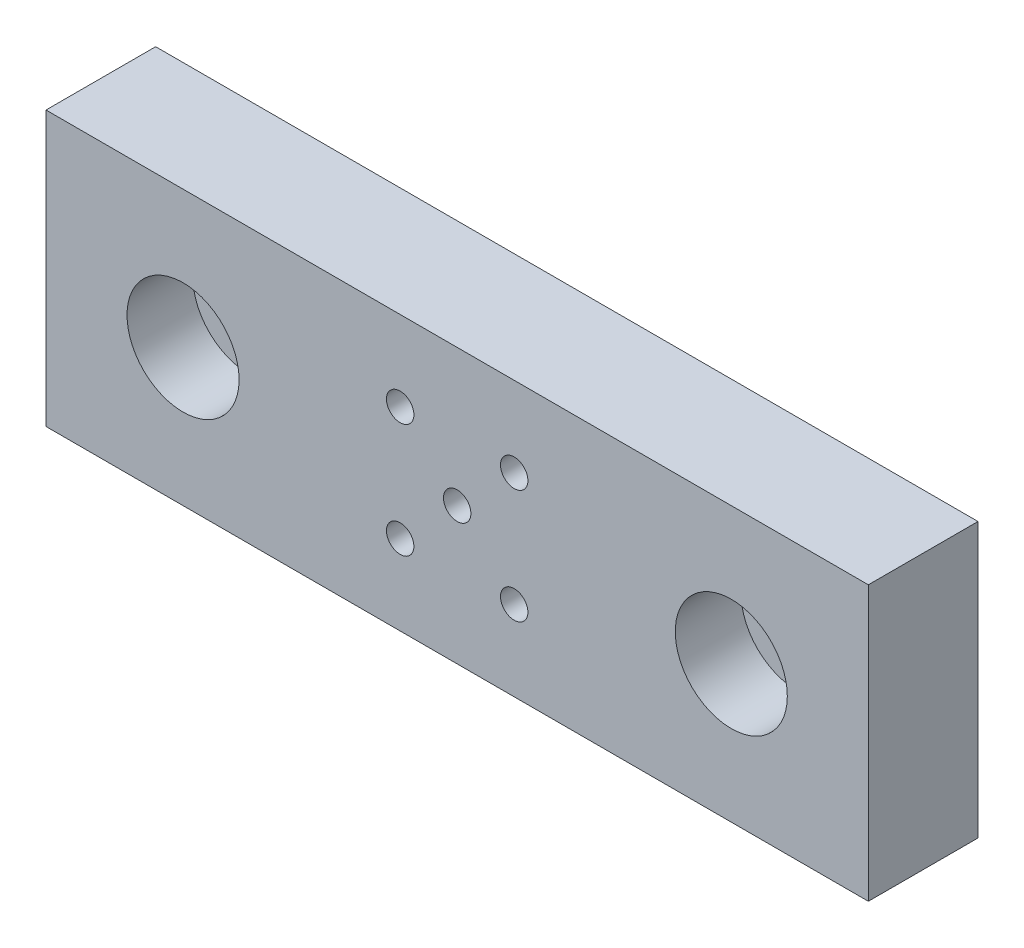
ISO-10303-21;
HEADER;
FILE_DESCRIPTION(('STEP AP214'),'2;1');
FILE_NAME('part.step','',(''),(''),'','','');
FILE_SCHEMA(('AUTOMOTIVE_DESIGN { 1 0 10303 214 1 1 1 1 }'));
ENDSEC;
DATA;
#1=APPLICATION_CONTEXT('core data for automotive mechanical design processes');
#2=APPLICATION_PROTOCOL_DEFINITION('international standard','automotive_design',2000,#1);
#3=PRODUCT_CONTEXT('',#1,'mechanical');
#4=PRODUCT('Part','Part','',(#3));
#5=PRODUCT_RELATED_PRODUCT_CATEGORY('part','',(#4));
#6=PRODUCT_DEFINITION_FORMATION('','',#4);
#7=PRODUCT_DEFINITION_CONTEXT('part definition',#1,'design');
#8=PRODUCT_DEFINITION('design','',#6,#7);
#9=PRODUCT_DEFINITION_SHAPE('','',#8);
#10=(LENGTH_UNIT() NAMED_UNIT(*) SI_UNIT(.MILLI.,.METRE.));
#11=(NAMED_UNIT(*) PLANE_ANGLE_UNIT() SI_UNIT($,.RADIAN.));
#12=(NAMED_UNIT(*) SI_UNIT($,.STERADIAN.) SOLID_ANGLE_UNIT());
#13=UNCERTAINTY_MEASURE_WITH_UNIT(LENGTH_MEASURE(1.E-05),#10,'distance_accuracy_value','');
#14=(GEOMETRIC_REPRESENTATION_CONTEXT(3) GLOBAL_UNCERTAINTY_ASSIGNED_CONTEXT((#13)) GLOBAL_UNIT_ASSIGNED_CONTEXT((#10,
#11,#12)) REPRESENTATION_CONTEXT('',''));
#15=CARTESIAN_POINT('',(0.,0.,0.));
#16=DIRECTION('',(0.,0.,1.));
#17=DIRECTION('',(1.,0.,0.));
#18=AXIS2_PLACEMENT_3D('',#15,#16,#17);
#19=CARTESIAN_POINT('',(25.,0.,10.));
#20=DIRECTION('',(0.,0.,-1.));
#21=DIRECTION('',(-1.,0.,0.));
#22=AXIS2_PLACEMENT_3D('',#19,#20,#21);
#23=CYLINDRICAL_SURFACE('',#22,3.25);
#24=CARTESIAN_POINT('',(25.,0.,0.));
#25=DIRECTION('',(0.,0.,1.));
#26=DIRECTION('',(1.,0.,0.));
#27=AXIS2_PLACEMENT_3D('',#24,#25,#26);
#28=CIRCLE('',#27,3.25);
#29=CARTESIAN_POINT('',(28.25,0.,0.));
#30=VERTEX_POINT('',#29);
#31=EDGE_CURVE('E155',#30,#30,#28,.T.);
#32=ORIENTED_EDGE('',*,*,#31,.F.);
#33=EDGE_LOOP('',(#32));
#34=FACE_BOUND('',#33,.T.);
#35=CARTESIAN_POINT('',(25.,0.,4.));
#36=DIRECTION('',(0.,0.,1.));
#37=DIRECTION('',(1.,0.,0.));
#38=AXIS2_PLACEMENT_3D('',#35,#36,#37);
#39=CIRCLE('',#38,3.25);
#40=CARTESIAN_POINT('',(28.25,0.,4.));
#41=VERTEX_POINT('',#40);
#42=EDGE_CURVE('E38',#41,#41,#39,.T.);
#43=ORIENTED_EDGE('',*,*,#42,.T.);
#44=EDGE_LOOP('',(#43));
#45=FACE_BOUND('',#44,.T.);
#46=ADVANCED_FACE('F34',(#34,#45),#23,.F.);
#47=CARTESIAN_POINT('',(-25.,0.,10.));
#48=DIRECTION('',(0.,0.,-1.));
#49=DIRECTION('',(-1.,0.,0.));
#50=AXIS2_PLACEMENT_3D('',#47,#48,#49);
#51=CYLINDRICAL_SURFACE('',#50,3.25);
#52=CARTESIAN_POINT('',(-25.,0.,0.));
#53=DIRECTION('',(0.,0.,1.));
#54=DIRECTION('',(1.,0.,0.));
#55=AXIS2_PLACEMENT_3D('',#52,#53,#54);
#56=CIRCLE('',#55,3.25);
#57=CARTESIAN_POINT('',(-21.75,0.,0.));
#58=VERTEX_POINT('',#57);
#59=EDGE_CURVE('E104',#58,#58,#56,.T.);
#60=ORIENTED_EDGE('',*,*,#59,.F.);
#61=EDGE_LOOP('',(#60));
#62=FACE_BOUND('',#61,.T.);
#63=CARTESIAN_POINT('',(-25.,0.,4.));
#64=DIRECTION('',(0.,0.,1.));
#65=DIRECTION('',(1.,0.,0.));
#66=AXIS2_PLACEMENT_3D('',#63,#64,#65);
#67=CIRCLE('',#66,3.25);
#68=CARTESIAN_POINT('',(-21.75,0.,4.));
#69=VERTEX_POINT('',#68);
#70=EDGE_CURVE('E111',#69,#69,#67,.T.);
#71=ORIENTED_EDGE('',*,*,#70,.T.);
#72=EDGE_LOOP('',(#71));
#73=FACE_BOUND('',#72,.T.);
#74=ADVANCED_FACE('F166',(#62,#73),#51,.F.);
#75=CARTESIAN_POINT('',(0.,0.,10.));
#76=DIRECTION('',(0.,0.,1.));
#77=DIRECTION('',(1.,0.,0.));
#78=AXIS2_PLACEMENT_3D('',#75,#76,#77);
#79=PLANE('',#78);
#80=CARTESIAN_POINT('',(25.,0.,10.));
#81=DIRECTION('',(0.,0.,1.));
#82=DIRECTION('',(1.,0.,0.));
#83=AXIS2_PLACEMENT_3D('',#80,#81,#82);
#84=CIRCLE('',#83,5.11);
#85=CARTESIAN_POINT('',(30.11,0.,10.));
#86=VERTEX_POINT('',#85);
#87=EDGE_CURVE('E128',#86,#86,#84,.T.);
#88=ORIENTED_EDGE('',*,*,#87,.F.);
#89=EDGE_LOOP('',(#88));
#90=FACE_BOUND('',#89,.T.);
#91=CARTESIAN_POINT('',(-25.,0.,10.));
#92=DIRECTION('',(0.,0.,1.));
#93=DIRECTION('',(1.,0.,0.));
#94=AXIS2_PLACEMENT_3D('',#91,#92,#93);
#95=CIRCLE('',#94,5.11);
#96=CARTESIAN_POINT('',(-19.89,0.,10.));
#97=VERTEX_POINT('',#96);
#98=EDGE_CURVE('E121',#97,#97,#95,.T.);
#99=ORIENTED_EDGE('',*,*,#98,.F.);
#100=EDGE_LOOP('',(#99));
#101=FACE_BOUND('',#100,.T.);
#102=CARTESIAN_POINT('',(5.20000000000001,-5.2,10.));
#103=DIRECTION('',(0.,0.,1.));
#104=DIRECTION('',(1.,0.,0.));
#105=AXIS2_PLACEMENT_3D('',#102,#103,#104);
#106=CIRCLE('',#105,1.25);
#107=CARTESIAN_POINT('',(6.45000000000001,-5.2,10.));
#108=VERTEX_POINT('',#107);
#109=EDGE_CURVE('E134',#108,#108,#106,.T.);
#110=ORIENTED_EDGE('',*,*,#109,.F.);
#111=EDGE_LOOP('',(#110));
#112=FACE_BOUND('',#111,.T.);
#113=CARTESIAN_POINT('',(-5.2,5.2,10.));
#114=DIRECTION('',(0.,0.,1.));
#115=DIRECTION('',(1.,0.,0.));
#116=AXIS2_PLACEMENT_3D('',#113,#114,#115);
#117=CIRCLE('',#116,1.25);
#118=CARTESIAN_POINT('',(-3.95,5.2,10.));
#119=VERTEX_POINT('',#118);
#120=EDGE_CURVE('E146',#119,#119,#117,.T.);
#121=ORIENTED_EDGE('',*,*,#120,.F.);
#122=EDGE_LOOP('',(#121));
#123=FACE_BOUND('',#122,.T.);
#124=DIRECTION('',(0.,1.,0.));
#125=VECTOR('',#124,1.);
#126=CARTESIAN_POINT('',(37.5,0.,10.));
#127=LINE('',#126,#125);
#128=CARTESIAN_POINT('',(37.5,-12.5,10.));
#129=VERTEX_POINT('',#128);
#130=CARTESIAN_POINT('',(37.5,12.5,10.));
#131=VERTEX_POINT('',#130);
#132=EDGE_CURVE('E81',#129,#131,#127,.T.);
#133=ORIENTED_EDGE('',*,*,#132,.T.);
#134=DIRECTION('',(-1.,0.,0.));
#135=VECTOR('',#134,1.);
#136=CARTESIAN_POINT('',(-37.5,12.5,10.));
#137=LINE('',#136,#135);
#138=CARTESIAN_POINT('',(-37.5,12.5,10.));
#139=VERTEX_POINT('',#138);
#140=EDGE_CURVE('E84',#131,#139,#137,.T.);
#141=ORIENTED_EDGE('',*,*,#140,.T.);
#142=DIRECTION('',(0.,-1.,0.));
#143=VECTOR('',#142,1.);
#144=CARTESIAN_POINT('',(-37.5,12.5,10.));
#145=LINE('',#144,#143);
#146=CARTESIAN_POINT('',(-37.5,-12.5,10.));
#147=VERTEX_POINT('',#146);
#148=EDGE_CURVE('E89',#139,#147,#145,.T.);
#149=ORIENTED_EDGE('',*,*,#148,.T.);
#150=DIRECTION('',(1.,0.,0.));
#151=VECTOR('',#150,1.);
#152=CARTESIAN_POINT('',(-37.5,-12.5,10.));
#153=LINE('',#152,#151);
#154=EDGE_CURVE('E53',#147,#129,#153,.T.);
#155=ORIENTED_EDGE('',*,*,#154,.T.);
#156=EDGE_LOOP('',(#133,#141,#149,#155));
#157=FACE_BOUND('',#156,.T.);
#158=CARTESIAN_POINT('',(0.,0.,10.));
#159=DIRECTION('',(0.,0.,1.));
#160=DIRECTION('',(1.,0.,0.));
#161=AXIS2_PLACEMENT_3D('',#158,#159,#160);
#162=CIRCLE('',#161,1.25);
#163=CARTESIAN_POINT('',(1.25000000000001,0.,10.));
#164=VERTEX_POINT('',#163);
#165=EDGE_CURVE('E152',#164,#164,#162,.T.);
#166=ORIENTED_EDGE('',*,*,#165,.F.);
#167=EDGE_LOOP('',(#166));
#168=FACE_BOUND('',#167,.T.);
#169=CARTESIAN_POINT('',(5.20000000000001,5.2,10.));
#170=DIRECTION('',(0.,0.,1.));
#171=DIRECTION('',(1.,0.,0.));
#172=AXIS2_PLACEMENT_3D('',#169,#170,#171);
#173=CIRCLE('',#172,1.25);
#174=CARTESIAN_POINT('',(6.45000000000001,5.2,10.));
#175=VERTEX_POINT('',#174);
#176=EDGE_CURVE('E140',#175,#175,#173,.T.);
#177=ORIENTED_EDGE('',*,*,#176,.F.);
#178=EDGE_LOOP('',(#177));
#179=FACE_BOUND('',#178,.T.);
#180=CARTESIAN_POINT('',(-5.2,-5.2,10.));
#181=DIRECTION('',(0.,0.,1.));
#182=DIRECTION('',(1.,0.,0.));
#183=AXIS2_PLACEMENT_3D('',#180,#181,#182);
#184=CIRCLE('',#183,1.25);
#185=CARTESIAN_POINT('',(-3.95,-5.2,10.));
#186=VERTEX_POINT('',#185);
#187=EDGE_CURVE('E118',#186,#186,#184,.T.);
#188=ORIENTED_EDGE('',*,*,#187,.F.);
#189=EDGE_LOOP('',(#188));
#190=FACE_BOUND('',#189,.T.);
#191=ADVANCED_FACE('F86',(#90,#101,#112,#123,#157,#168,#179,#190),#79,.T.);
#192=CARTESIAN_POINT('',(0.,0.,0.));
#193=DIRECTION('',(0.,0.,1.));
#194=DIRECTION('',(1.,0.,0.));
#195=AXIS2_PLACEMENT_3D('',#192,#193,#194);
#196=PLANE('',#195);
#197=DIRECTION('',(0.,1.,0.));
#198=VECTOR('',#197,1.);
#199=CARTESIAN_POINT('',(37.5,12.5,0.));
#200=LINE('',#199,#198);
#201=CARTESIAN_POINT('',(37.5,-12.5,0.));
#202=VERTEX_POINT('',#201);
#203=CARTESIAN_POINT('',(37.5,12.5,0.));
#204=VERTEX_POINT('',#203);
#205=EDGE_CURVE('E76',#202,#204,#200,.T.);
#206=ORIENTED_EDGE('',*,*,#205,.F.);
#207=DIRECTION('',(1.,0.,0.));
#208=VECTOR('',#207,1.);
#209=CARTESIAN_POINT('',(-37.5,-12.5,0.));
#210=LINE('',#209,#208);
#211=CARTESIAN_POINT('',(-37.5,-12.5,0.));
#212=VERTEX_POINT('',#211);
#213=EDGE_CURVE('E107',#212,#202,#210,.T.);
#214=ORIENTED_EDGE('',*,*,#213,.F.);
#215=DIRECTION('',(0.,-1.,0.));
#216=VECTOR('',#215,1.);
#217=CARTESIAN_POINT('',(-37.5,0.,0.));
#218=LINE('',#217,#216);
#219=CARTESIAN_POINT('',(-37.5,12.5,0.));
#220=VERTEX_POINT('',#219);
#221=EDGE_CURVE('E69',#220,#212,#218,.T.);
#222=ORIENTED_EDGE('',*,*,#221,.F.);
#223=DIRECTION('',(-1.,0.,0.));
#224=VECTOR('',#223,1.);
#225=CARTESIAN_POINT('',(-37.5,12.5,0.));
#226=LINE('',#225,#224);
#227=EDGE_CURVE('E94',#204,#220,#226,.T.);
#228=ORIENTED_EDGE('',*,*,#227,.F.);
#229=EDGE_LOOP('',(#206,#214,#222,#228));
#230=FACE_BOUND('',#229,.T.);
#231=ORIENTED_EDGE('',*,*,#59,.T.);
#232=EDGE_LOOP('',(#231));
#233=FACE_BOUND('',#232,.T.);
#234=ORIENTED_EDGE('',*,*,#31,.T.);
#235=EDGE_LOOP('',(#234));
#236=FACE_BOUND('',#235,.T.);
#237=CARTESIAN_POINT('',(0.,0.,0.));
#238=DIRECTION('',(0.,0.,1.));
#239=DIRECTION('',(1.,0.,0.));
#240=AXIS2_PLACEMENT_3D('',#237,#238,#239);
#241=CIRCLE('',#240,1.25);
#242=CARTESIAN_POINT('',(1.25000000000001,0.,0.));
#243=VERTEX_POINT('',#242);
#244=EDGE_CURVE('E149',#243,#243,#241,.T.);
#245=ORIENTED_EDGE('',*,*,#244,.T.);
#246=EDGE_LOOP('',(#245));
#247=FACE_BOUND('',#246,.T.);
#248=CARTESIAN_POINT('',(-5.2,5.2,0.));
#249=DIRECTION('',(0.,0.,1.));
#250=DIRECTION('',(1.,0.,0.));
#251=AXIS2_PLACEMENT_3D('',#248,#249,#250);
#252=CIRCLE('',#251,1.25);
#253=CARTESIAN_POINT('',(-3.95,5.2,0.));
#254=VERTEX_POINT('',#253);
#255=EDGE_CURVE('E143',#254,#254,#252,.T.);
#256=ORIENTED_EDGE('',*,*,#255,.T.);
#257=EDGE_LOOP('',(#256));
#258=FACE_BOUND('',#257,.T.);
#259=CARTESIAN_POINT('',(5.20000000000001,5.2,0.));
#260=DIRECTION('',(0.,0.,1.));
#261=DIRECTION('',(1.,0.,0.));
#262=AXIS2_PLACEMENT_3D('',#259,#260,#261);
#263=CIRCLE('',#262,1.25);
#264=CARTESIAN_POINT('',(6.45000000000001,5.2,0.));
#265=VERTEX_POINT('',#264);
#266=EDGE_CURVE('E137',#265,#265,#263,.T.);
#267=ORIENTED_EDGE('',*,*,#266,.T.);
#268=EDGE_LOOP('',(#267));
#269=FACE_BOUND('',#268,.T.);
#270=CARTESIAN_POINT('',(5.20000000000001,-5.2,0.));
#271=DIRECTION('',(0.,0.,1.));
#272=DIRECTION('',(1.,0.,0.));
#273=AXIS2_PLACEMENT_3D('',#270,#271,#272);
#274=CIRCLE('',#273,1.25);
#275=CARTESIAN_POINT('',(6.45000000000001,-5.2,0.));
#276=VERTEX_POINT('',#275);
#277=EDGE_CURVE('E132',#276,#276,#274,.T.);
#278=ORIENTED_EDGE('',*,*,#277,.T.);
#279=EDGE_LOOP('',(#278));
#280=FACE_BOUND('',#279,.T.);
#281=CARTESIAN_POINT('',(-5.2,-5.2,0.));
#282=DIRECTION('',(0.,0.,1.));
#283=DIRECTION('',(1.,0.,0.));
#284=AXIS2_PLACEMENT_3D('',#281,#282,#283);
#285=CIRCLE('',#284,1.25);
#286=CARTESIAN_POINT('',(-3.95,-5.2,0.));
#287=VERTEX_POINT('',#286);
#288=EDGE_CURVE('E113',#287,#287,#285,.T.);
#289=ORIENTED_EDGE('',*,*,#288,.T.);
#290=EDGE_LOOP('',(#289));
#291=FACE_BOUND('',#290,.T.);
#292=ADVANCED_FACE('F163',(#230,#233,#236,#247,#258,#269,#280,#291),#196,.F.);
#293=CARTESIAN_POINT('',(37.5,12.5,10.));
#294=DIRECTION('',(-1.,0.,0.));
#295=DIRECTION('',(0.,0.,1.));
#296=AXIS2_PLACEMENT_3D('',#293,#294,#295);
#297=PLANE('',#296);
#298=ORIENTED_EDGE('',*,*,#205,.T.);
#299=DIRECTION('',(0.,0.,-1.));
#300=VECTOR('',#299,1.);
#301=CARTESIAN_POINT('',(37.5,12.5,10.));
#302=LINE('',#301,#300);
#303=EDGE_CURVE('E11',#131,#204,#302,.T.);
#304=ORIENTED_EDGE('',*,*,#303,.F.);
#305=ORIENTED_EDGE('',*,*,#132,.F.);
#306=DIRECTION('',(0.,0.,-1.));
#307=VECTOR('',#306,1.);
#308=CARTESIAN_POINT('',(37.5,-12.5,10.));
#309=LINE('',#308,#307);
#310=EDGE_CURVE('E99',#129,#202,#309,.T.);
#311=ORIENTED_EDGE('',*,*,#310,.T.);
#312=EDGE_LOOP('',(#298,#304,#305,#311));
#313=FACE_BOUND('',#312,.T.);
#314=ADVANCED_FACE('F36',(#313),#297,.F.);
#315=CARTESIAN_POINT('',(-37.5,12.5,10.));
#316=DIRECTION('',(0.,-1.,0.));
#317=DIRECTION('',(0.,0.,-1.));
#318=AXIS2_PLACEMENT_3D('',#315,#316,#317);
#319=PLANE('',#318);
#320=ORIENTED_EDGE('',*,*,#227,.T.);
#321=DIRECTION('',(0.,0.,-1.));
#322=VECTOR('',#321,1.);
#323=CARTESIAN_POINT('',(-37.5,12.5,10.));
#324=LINE('',#323,#322);
#325=EDGE_CURVE('E44',#139,#220,#324,.T.);
#326=ORIENTED_EDGE('',*,*,#325,.F.);
#327=ORIENTED_EDGE('',*,*,#140,.F.);
#328=ORIENTED_EDGE('',*,*,#303,.T.);
#329=EDGE_LOOP('',(#320,#326,#327,#328));
#330=FACE_BOUND('',#329,.T.);
#331=ADVANCED_FACE('F93',(#330),#319,.F.);
#332=CARTESIAN_POINT('',(-37.5,0.,10.));
#333=DIRECTION('',(1.,0.,0.));
#334=DIRECTION('',(0.,1.,0.));
#335=AXIS2_PLACEMENT_3D('',#332,#333,#334);
#336=PLANE('',#335);
#337=ORIENTED_EDGE('',*,*,#221,.T.);
#338=DIRECTION('',(0.,0.,-1.));
#339=VECTOR('',#338,1.);
#340=CARTESIAN_POINT('',(-37.5,-12.5,10.));
#341=LINE('',#340,#339);
#342=EDGE_CURVE('E95',#147,#212,#341,.T.);
#343=ORIENTED_EDGE('',*,*,#342,.F.);
#344=ORIENTED_EDGE('',*,*,#148,.F.);
#345=ORIENTED_EDGE('',*,*,#325,.T.);
#346=EDGE_LOOP('',(#337,#343,#344,#345));
#347=FACE_BOUND('',#346,.T.);
#348=ADVANCED_FACE('F97',(#347),#336,.F.);
#349=CARTESIAN_POINT('',(-37.5,-12.5,10.));
#350=DIRECTION('',(0.,1.,0.));
#351=DIRECTION('',(0.,0.,1.));
#352=AXIS2_PLACEMENT_3D('',#349,#350,#351);
#353=PLANE('',#352);
#354=ORIENTED_EDGE('',*,*,#213,.T.);
#355=ORIENTED_EDGE('',*,*,#310,.F.);
#356=ORIENTED_EDGE('',*,*,#154,.F.);
#357=ORIENTED_EDGE('',*,*,#342,.T.);
#358=EDGE_LOOP('',(#354,#355,#356,#357));
#359=FACE_BOUND('',#358,.T.);
#360=ADVANCED_FACE('F181',(#359),#353,.F.);
#361=CARTESIAN_POINT('',(0.,0.,10.));
#362=DIRECTION('',(0.,0.,-1.));
#363=DIRECTION('',(-1.,0.,0.));
#364=AXIS2_PLACEMENT_3D('',#361,#362,#363);
#365=CYLINDRICAL_SURFACE('',#364,1.25);
#366=ORIENTED_EDGE('',*,*,#165,.T.);
#367=EDGE_LOOP('',(#366));
#368=FACE_BOUND('',#367,.T.);
#369=ORIENTED_EDGE('',*,*,#244,.F.);
#370=EDGE_LOOP('',(#369));
#371=FACE_BOUND('',#370,.T.);
#372=ADVANCED_FACE('F184',(#368,#371),#365,.F.);
#373=CARTESIAN_POINT('',(-5.2,5.2,10.));
#374=DIRECTION('',(0.,0.,-1.));
#375=DIRECTION('',(-1.,0.,0.));
#376=AXIS2_PLACEMENT_3D('',#373,#374,#375);
#377=CYLINDRICAL_SURFACE('',#376,1.25);
#378=ORIENTED_EDGE('',*,*,#120,.T.);
#379=EDGE_LOOP('',(#378));
#380=FACE_BOUND('',#379,.T.);
#381=ORIENTED_EDGE('',*,*,#255,.F.);
#382=EDGE_LOOP('',(#381));
#383=FACE_BOUND('',#382,.T.);
#384=ADVANCED_FACE('F264',(#380,#383),#377,.F.);
#385=CARTESIAN_POINT('',(5.20000000000001,5.2,10.));
#386=DIRECTION('',(0.,0.,-1.));
#387=DIRECTION('',(-1.,0.,0.));
#388=AXIS2_PLACEMENT_3D('',#385,#386,#387);
#389=CYLINDRICAL_SURFACE('',#388,1.25);
#390=ORIENTED_EDGE('',*,*,#176,.T.);
#391=EDGE_LOOP('',(#390));
#392=FACE_BOUND('',#391,.T.);
#393=ORIENTED_EDGE('',*,*,#266,.F.);
#394=EDGE_LOOP('',(#393));
#395=FACE_BOUND('',#394,.T.);
#396=ADVANCED_FACE('F260',(#392,#395),#389,.F.);
#397=CARTESIAN_POINT('',(5.20000000000001,-5.2,10.));
#398=DIRECTION('',(0.,0.,-1.));
#399=DIRECTION('',(-1.,0.,0.));
#400=AXIS2_PLACEMENT_3D('',#397,#398,#399);
#401=CYLINDRICAL_SURFACE('',#400,1.25);
#402=ORIENTED_EDGE('',*,*,#109,.T.);
#403=EDGE_LOOP('',(#402));
#404=FACE_BOUND('',#403,.T.);
#405=ORIENTED_EDGE('',*,*,#277,.F.);
#406=EDGE_LOOP('',(#405));
#407=FACE_BOUND('',#406,.T.);
#408=ADVANCED_FACE('F256',(#404,#407),#401,.F.);
#409=CARTESIAN_POINT('',(-5.2,-5.2,10.));
#410=DIRECTION('',(0.,0.,-1.));
#411=DIRECTION('',(-1.,0.,0.));
#412=AXIS2_PLACEMENT_3D('',#409,#410,#411);
#413=CYLINDRICAL_SURFACE('',#412,1.25);
#414=ORIENTED_EDGE('',*,*,#187,.T.);
#415=EDGE_LOOP('',(#414));
#416=FACE_BOUND('',#415,.T.);
#417=ORIENTED_EDGE('',*,*,#288,.F.);
#418=EDGE_LOOP('',(#417));
#419=FACE_BOUND('',#418,.T.);
#420=ADVANCED_FACE('F215',(#416,#419),#413,.F.);
#421=CARTESIAN_POINT('',(-25.,0.,4.));
#422=DIRECTION('',(0.,0.,1.));
#423=DIRECTION('',(1.,0.,0.));
#424=AXIS2_PLACEMENT_3D('',#421,#422,#423);
#425=CYLINDRICAL_SURFACE('',#424,5.11);
#426=CARTESIAN_POINT('',(-25.,0.,4.));
#427=DIRECTION('',(0.,0.,1.));
#428=DIRECTION('',(1.,0.,0.));
#429=AXIS2_PLACEMENT_3D('',#426,#427,#428);
#430=CIRCLE('',#429,5.11);
#431=CARTESIAN_POINT('',(-19.89,0.,4.));
#432=VERTEX_POINT('',#431);
#433=EDGE_CURVE('E114',#432,#432,#430,.T.);
#434=ORIENTED_EDGE('',*,*,#433,.F.);
#435=EDGE_LOOP('',(#434));
#436=FACE_BOUND('',#435,.T.);
#437=ORIENTED_EDGE('',*,*,#98,.T.);
#438=EDGE_LOOP('',(#437));
#439=FACE_BOUND('',#438,.T.);
#440=ADVANCED_FACE('F209',(#436,#439),#425,.F.);
#441=CARTESIAN_POINT('',(-25.,0.,4.));
#442=DIRECTION('',(0.,0.,1.));
#443=DIRECTION('',(1.,0.,0.));
#444=AXIS2_PLACEMENT_3D('',#441,#442,#443);
#445=PLANE('',#444);
#446=ORIENTED_EDGE('',*,*,#70,.F.);
#447=EDGE_LOOP('',(#446));
#448=FACE_BOUND('',#447,.T.);
#449=ORIENTED_EDGE('',*,*,#433,.T.);
#450=EDGE_LOOP('',(#449));
#451=FACE_BOUND('',#450,.T.);
#452=ADVANCED_FACE('F214',(#448,#451),#445,.T.);
#453=CARTESIAN_POINT('',(25.,0.,4.));
#454=DIRECTION('',(0.,0.,1.));
#455=DIRECTION('',(1.,0.,0.));
#456=AXIS2_PLACEMENT_3D('',#453,#454,#455);
#457=CYLINDRICAL_SURFACE('',#456,5.11);
#458=CARTESIAN_POINT('',(25.,0.,4.));
#459=DIRECTION('',(0.,0.,1.));
#460=DIRECTION('',(1.,0.,0.));
#461=AXIS2_PLACEMENT_3D('',#458,#459,#460);
#462=CIRCLE('',#461,5.11);
#463=CARTESIAN_POINT('',(30.11,0.,4.));
#464=VERTEX_POINT('',#463);
#465=EDGE_CURVE('E373',#464,#464,#462,.T.);
#466=ORIENTED_EDGE('',*,*,#465,.F.);
#467=EDGE_LOOP('',(#466));
#468=FACE_BOUND('',#467,.T.);
#469=ORIENTED_EDGE('',*,*,#87,.T.);
#470=EDGE_LOOP('',(#469));
#471=FACE_BOUND('',#470,.T.);
#472=ADVANCED_FACE('F227',(#468,#471),#457,.F.);
#473=CARTESIAN_POINT('',(25.,0.,4.));
#474=DIRECTION('',(0.,0.,1.));
#475=DIRECTION('',(1.,0.,0.));
#476=AXIS2_PLACEMENT_3D('',#473,#474,#475);
#477=PLANE('',#476);
#478=ORIENTED_EDGE('',*,*,#42,.F.);
#479=EDGE_LOOP('',(#478));
#480=FACE_BOUND('',#479,.T.);
#481=ORIENTED_EDGE('',*,*,#465,.T.);
#482=EDGE_LOOP('',(#481));
#483=FACE_BOUND('',#482,.T.);
#484=ADVANCED_FACE('F237',(#480,#483),#477,.T.);
#485=CLOSED_SHELL('',(#46,#74,#191,#292,#314,#331,#348,#360,#372,#384,#396,#408,#420,#440,#452,
#472,#484));
#486=MANIFOLD_SOLID_BREP('B2',#485);
#487=ADVANCED_BREP_SHAPE_REPRESENTATION('',(#18,#486),#14);
#488=SHAPE_DEFINITION_REPRESENTATION(#9,#487);
ENDSEC;
END-ISO-10303-21;
